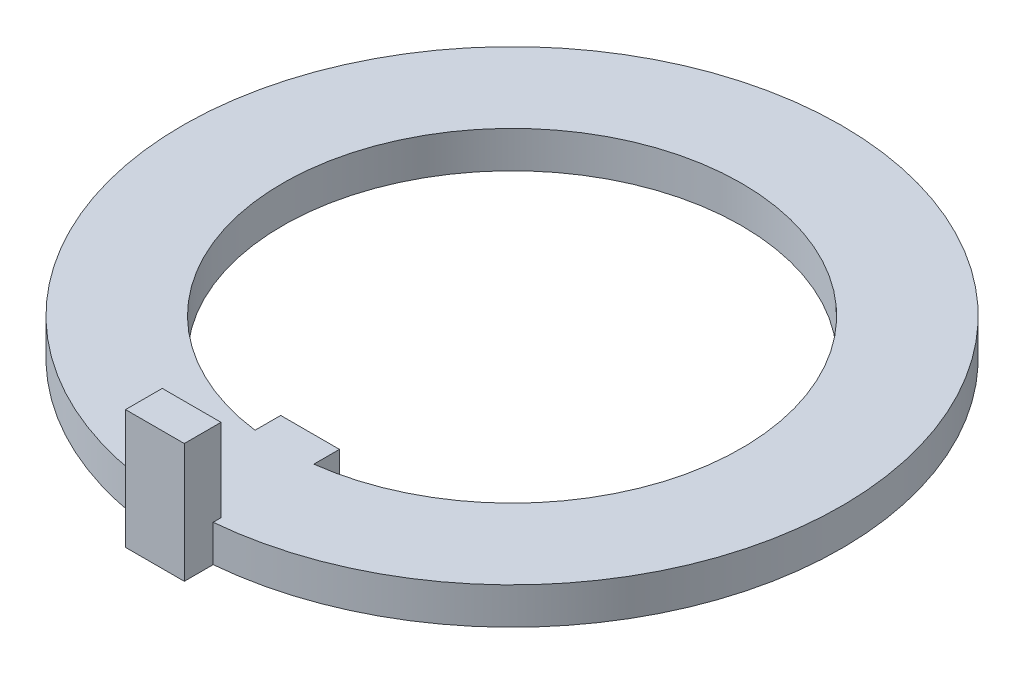
ISO-10303-21;
HEADER;
FILE_DESCRIPTION(('STEP AP214'),'2;1');
FILE_NAME('part.step','',(''),(''),'','','');
FILE_SCHEMA(('AUTOMOTIVE_DESIGN { 1 0 10303 214 1 1 1 1 }'));
ENDSEC;
DATA;
#1=APPLICATION_CONTEXT('core data for automotive mechanical design processes');
#2=APPLICATION_PROTOCOL_DEFINITION('international standard','automotive_design',2000,#1);
#3=PRODUCT_CONTEXT('',#1,'mechanical');
#4=PRODUCT('Part','Part','',(#3));
#5=PRODUCT_RELATED_PRODUCT_CATEGORY('part','',(#4));
#6=PRODUCT_DEFINITION_FORMATION('','',#4);
#7=PRODUCT_DEFINITION_CONTEXT('part definition',#1,'design');
#8=PRODUCT_DEFINITION('design','',#6,#7);
#9=PRODUCT_DEFINITION_SHAPE('','',#8);
#10=(LENGTH_UNIT() NAMED_UNIT(*) SI_UNIT(.MILLI.,.METRE.));
#11=(NAMED_UNIT(*) PLANE_ANGLE_UNIT() SI_UNIT($,.RADIAN.));
#12=(NAMED_UNIT(*) SI_UNIT($,.STERADIAN.) SOLID_ANGLE_UNIT());
#13=UNCERTAINTY_MEASURE_WITH_UNIT(LENGTH_MEASURE(1.E-05),#10,'distance_accuracy_value','');
#14=(GEOMETRIC_REPRESENTATION_CONTEXT(3) GLOBAL_UNCERTAINTY_ASSIGNED_CONTEXT((#13)) GLOBAL_UNIT_ASSIGNED_CONTEXT((#10,
#11,#12)) REPRESENTATION_CONTEXT('',''));
#15=CARTESIAN_POINT('',(0.,0.,0.));
#16=DIRECTION('',(0.,0.,1.));
#17=DIRECTION('',(1.,0.,0.));
#18=AXIS2_PLACEMENT_3D('',#15,#16,#17);
#19=CARTESIAN_POINT('',(0.,1.016,0.));
#20=DIRECTION('',(0.,1.,0.));
#21=DIRECTION('',(0.,0.,1.));
#22=AXIS2_PLACEMENT_3D('',#19,#20,#21);
#23=PLANE('',#22);
#24=DIRECTION('',(0.,0.,1.));
#25=VECTOR('',#24,1.);
#26=CARTESIAN_POINT('',(-0.8128,1.016,9.8806));
#27=LINE('',#26,#25);
#28=CARTESIAN_POINT('',(-0.8128,1.016,8.8646));
#29=VERTEX_POINT('',#28);
#30=CARTESIAN_POINT('',(-0.8128,1.016,9.08230268819532));
#31=VERTEX_POINT('',#30);
#32=EDGE_CURVE('E51',#29,#31,#27,.T.);
#33=ORIENTED_EDGE('',*,*,#32,.F.);
#34=DIRECTION('',(-1.,0.,0.));
#35=VECTOR('',#34,1.);
#36=CARTESIAN_POINT('',(-0.8128,1.016,8.8646));
#37=LINE('',#36,#35);
#38=CARTESIAN_POINT('',(0.8128,1.016,8.8646));
#39=VERTEX_POINT('',#38);
#40=EDGE_CURVE('E139',#39,#29,#37,.T.);
#41=ORIENTED_EDGE('',*,*,#40,.F.);
#42=DIRECTION('',(0.,0.,-1.));
#43=VECTOR('',#42,1.);
#44=CARTESIAN_POINT('',(0.8128,1.016,9.8806));
#45=LINE('',#44,#43);
#46=CARTESIAN_POINT('',(0.8128,1.016,9.08230268819532));
#47=VERTEX_POINT('',#46);
#48=EDGE_CURVE('E11',#47,#39,#45,.T.);
#49=ORIENTED_EDGE('',*,*,#48,.F.);
#50=CARTESIAN_POINT('',(0.,1.016,0.));
#51=DIRECTION('',(0.,1.,0.));
#52=DIRECTION('',(0.,0.,1.));
#53=AXIS2_PLACEMENT_3D('',#50,#51,#52);
#54=CIRCLE('',#53,9.1186);
#55=EDGE_CURVE('E160',#47,#31,#54,.T.);
#56=ORIENTED_EDGE('',*,*,#55,.T.);
#57=EDGE_LOOP('',(#33,#41,#49,#56));
#58=FACE_BOUND('',#57,.T.);
#59=DIRECTION('',(1.,0.,0.));
#60=VECTOR('',#59,1.);
#61=CARTESIAN_POINT('',(0.8128,1.016,5.588));
#62=LINE('',#61,#60);
#63=CARTESIAN_POINT('',(-0.8128,1.016,5.588));
#64=VERTEX_POINT('',#63);
#65=CARTESIAN_POINT('',(0.8128,1.016,5.588));
#66=VERTEX_POINT('',#65);
#67=EDGE_CURVE('E209',#64,#66,#62,.T.);
#68=ORIENTED_EDGE('',*,*,#67,.F.);
#69=DIRECTION('',(0.,0.,-1.));
#70=VECTOR('',#69,1.);
#71=CARTESIAN_POINT('',(-0.8128,1.016,6.29776596580089));
#72=LINE('',#71,#70);
#73=CARTESIAN_POINT('',(-0.812800000000002,1.016,6.29776596580089));
#74=VERTEX_POINT('',#73);
#75=EDGE_CURVE('E153',#74,#64,#72,.T.);
#76=ORIENTED_EDGE('',*,*,#75,.F.);
#77=CARTESIAN_POINT('',(0.,1.016,0.));
#78=DIRECTION('',(0.,1.,0.));
#79=DIRECTION('',(0.,0.,1.));
#80=AXIS2_PLACEMENT_3D('',#77,#78,#79);
#81=CIRCLE('',#80,6.35);
#82=CARTESIAN_POINT('',(0.8128,1.016,6.29776596580089));
#83=VERTEX_POINT('',#82);
#84=EDGE_CURVE('E195',#83,#74,#81,.T.);
#85=ORIENTED_EDGE('',*,*,#84,.F.);
#86=DIRECTION('',(0.,0.,1.));
#87=VECTOR('',#86,1.);
#88=CARTESIAN_POINT('',(0.8128,1.016,6.29776596580089));
#89=LINE('',#88,#87);
#90=EDGE_CURVE('E208',#66,#83,#89,.T.);
#91=ORIENTED_EDGE('',*,*,#90,.F.);
#92=EDGE_LOOP('',(#68,#76,#85,#91));
#93=FACE_BOUND('',#92,.T.);
#94=ADVANCED_FACE('F34',(#58,#93),#23,.T.);
#95=CARTESIAN_POINT('',(0.,0.,0.));
#96=DIRECTION('',(0.,1.,0.));
#97=DIRECTION('',(0.,0.,1.));
#98=AXIS2_PLACEMENT_3D('',#95,#96,#97);
#99=PLANE('',#98);
#100=DIRECTION('',(0.,0.,-1.));
#101=VECTOR('',#100,1.);
#102=CARTESIAN_POINT('',(0.8128,0.,9.8806));
#103=LINE('',#102,#101);
#104=CARTESIAN_POINT('',(0.8128,0.,9.8806));
#105=VERTEX_POINT('',#104);
#106=CARTESIAN_POINT('',(0.8128,0.,9.08230268819532));
#107=VERTEX_POINT('',#106);
#108=EDGE_CURVE('E178',#105,#107,#103,.T.);
#109=ORIENTED_EDGE('',*,*,#108,.F.);
#110=DIRECTION('',(1.,0.,0.));
#111=VECTOR('',#110,1.);
#112=CARTESIAN_POINT('',(0.8128,0.,9.8806));
#113=LINE('',#112,#111);
#114=CARTESIAN_POINT('',(-0.8128,0.,9.8806));
#115=VERTEX_POINT('',#114);
#116=EDGE_CURVE('E162',#115,#105,#113,.T.);
#117=ORIENTED_EDGE('',*,*,#116,.F.);
#118=DIRECTION('',(0.,0.,1.));
#119=VECTOR('',#118,1.);
#120=CARTESIAN_POINT('',(-0.8128,0.,9.8806));
#121=LINE('',#120,#119);
#122=CARTESIAN_POINT('',(-0.8128,0.,9.08230268819532));
#123=VERTEX_POINT('',#122);
#124=EDGE_CURVE('E121',#123,#115,#121,.T.);
#125=ORIENTED_EDGE('',*,*,#124,.F.);
#126=CARTESIAN_POINT('',(0.,0.,0.));
#127=DIRECTION('',(0.,1.,0.));
#128=DIRECTION('',(0.,0.,1.));
#129=AXIS2_PLACEMENT_3D('',#126,#127,#128);
#130=CIRCLE('',#129,9.1186);
#131=EDGE_CURVE('E175',#107,#123,#130,.T.);
#132=ORIENTED_EDGE('',*,*,#131,.F.);
#133=EDGE_LOOP('',(#109,#117,#125,#132));
#134=FACE_BOUND('',#133,.T.);
#135=DIRECTION('',(0.,0.,-1.));
#136=VECTOR('',#135,1.);
#137=CARTESIAN_POINT('',(-0.8128,0.,6.29776596580089));
#138=LINE('',#137,#136);
#139=CARTESIAN_POINT('',(-0.812800000000002,0.,6.29776596580089));
#140=VERTEX_POINT('',#139);
#141=CARTESIAN_POINT('',(-0.8128,0.,5.588));
#142=VERTEX_POINT('',#141);
#143=EDGE_CURVE('E150',#140,#142,#138,.T.);
#144=ORIENTED_EDGE('',*,*,#143,.T.);
#145=DIRECTION('',(1.,0.,0.));
#146=VECTOR('',#145,1.);
#147=CARTESIAN_POINT('',(0.8128,0.,5.588));
#148=LINE('',#147,#146);
#149=CARTESIAN_POINT('',(0.8128,0.,5.588));
#150=VERTEX_POINT('',#149);
#151=EDGE_CURVE('E202',#142,#150,#148,.T.);
#152=ORIENTED_EDGE('',*,*,#151,.T.);
#153=DIRECTION('',(0.,0.,1.));
#154=VECTOR('',#153,1.);
#155=CARTESIAN_POINT('',(0.8128,0.,6.29776596580089));
#156=LINE('',#155,#154);
#157=CARTESIAN_POINT('',(0.8128,0.,6.29776596580089));
#158=VERTEX_POINT('',#157);
#159=EDGE_CURVE('E199',#150,#158,#156,.T.);
#160=ORIENTED_EDGE('',*,*,#159,.T.);
#161=CARTESIAN_POINT('',(0.,0.,0.));
#162=DIRECTION('',(0.,1.,0.));
#163=DIRECTION('',(0.,0.,1.));
#164=AXIS2_PLACEMENT_3D('',#161,#162,#163);
#165=CIRCLE('',#164,6.35);
#166=EDGE_CURVE('E196',#158,#140,#165,.T.);
#167=ORIENTED_EDGE('',*,*,#166,.T.);
#168=EDGE_LOOP('',(#144,#152,#160,#167));
#169=FACE_BOUND('',#168,.T.);
#170=ADVANCED_FACE('F173',(#134,#169),#99,.F.);
#171=CARTESIAN_POINT('',(0.8128,1.016,9.8806));
#172=DIRECTION('',(-1.,0.,0.));
#173=DIRECTION('',(0.,0.,1.));
#174=AXIS2_PLACEMENT_3D('',#171,#172,#173);
#175=PLANE('',#174);
#176=ORIENTED_EDGE('',*,*,#108,.T.);
#177=DIRECTION('',(0.,-1.,0.));
#178=VECTOR('',#177,1.);
#179=CARTESIAN_POINT('',(0.8128,1.016,9.08230268819532));
#180=LINE('',#179,#178);
#181=EDGE_CURVE('E43',#47,#107,#180,.T.);
#182=ORIENTED_EDGE('',*,*,#181,.F.);
#183=ORIENTED_EDGE('',*,*,#48,.T.);
#184=DIRECTION('',(0.,-1.,0.));
#185=VECTOR('',#184,1.);
#186=CARTESIAN_POINT('',(0.8128,3.302,8.8646));
#187=LINE('',#186,#185);
#188=CARTESIAN_POINT('',(0.8128,3.302,8.8646));
#189=VERTEX_POINT('',#188);
#190=EDGE_CURVE('E147',#189,#39,#187,.T.);
#191=ORIENTED_EDGE('',*,*,#190,.F.);
#192=DIRECTION('',(0.,0.,-1.));
#193=VECTOR('',#192,1.);
#194=CARTESIAN_POINT('',(0.8128,3.302,9.8806));
#195=LINE('',#194,#193);
#196=CARTESIAN_POINT('',(0.8128,3.302,9.8806));
#197=VERTEX_POINT('',#196);
#198=EDGE_CURVE('E133',#197,#189,#195,.T.);
#199=ORIENTED_EDGE('',*,*,#198,.F.);
#200=DIRECTION('',(0.,-1.,0.));
#201=VECTOR('',#200,1.);
#202=CARTESIAN_POINT('',(0.8128,1.016,9.8806));
#203=LINE('',#202,#201);
#204=EDGE_CURVE('E125',#197,#105,#203,.T.);
#205=ORIENTED_EDGE('',*,*,#204,.T.);
#206=EDGE_LOOP('',(#176,#182,#183,#191,#199,#205));
#207=FACE_BOUND('',#206,.T.);
#208=ADVANCED_FACE('F36',(#207),#175,.F.);
#209=CARTESIAN_POINT('',(0.,1.016,0.));
#210=DIRECTION('',(0.,-1.,0.));
#211=DIRECTION('',(0.,0.,-1.));
#212=AXIS2_PLACEMENT_3D('',#209,#210,#211);
#213=CYLINDRICAL_SURFACE('',#212,9.1186);
#214=ORIENTED_EDGE('',*,*,#131,.T.);
#215=DIRECTION('',(0.,-1.,0.));
#216=VECTOR('',#215,1.);
#217=CARTESIAN_POINT('',(-0.8128,1.016,9.08230268819532));
#218=LINE('',#217,#216);
#219=EDGE_CURVE('E124',#31,#123,#218,.T.);
#220=ORIENTED_EDGE('',*,*,#219,.F.);
#221=ORIENTED_EDGE('',*,*,#55,.F.);
#222=ORIENTED_EDGE('',*,*,#181,.T.);
#223=EDGE_LOOP('',(#214,#220,#221,#222));
#224=FACE_BOUND('',#223,.T.);
#225=ADVANCED_FACE('F248',(#224),#213,.T.);
#226=CARTESIAN_POINT('',(-0.8128,1.016,9.8806));
#227=DIRECTION('',(1.,0.,0.));
#228=DIRECTION('',(0.,0.,-1.));
#229=AXIS2_PLACEMENT_3D('',#226,#227,#228);
#230=PLANE('',#229);
#231=ORIENTED_EDGE('',*,*,#124,.T.);
#232=DIRECTION('',(0.,-1.,0.));
#233=VECTOR('',#232,1.);
#234=CARTESIAN_POINT('',(-0.8128,1.016,9.8806));
#235=LINE('',#234,#233);
#236=CARTESIAN_POINT('',(-0.8128,3.302,9.8806));
#237=VERTEX_POINT('',#236);
#238=EDGE_CURVE('E113',#237,#115,#235,.T.);
#239=ORIENTED_EDGE('',*,*,#238,.F.);
#240=DIRECTION('',(0.,0.,1.));
#241=VECTOR('',#240,1.);
#242=CARTESIAN_POINT('',(-0.8128,3.302,9.8806));
#243=LINE('',#242,#241);
#244=CARTESIAN_POINT('',(-0.8128,3.302,8.8646));
#245=VERTEX_POINT('',#244);
#246=EDGE_CURVE('E118',#245,#237,#243,.T.);
#247=ORIENTED_EDGE('',*,*,#246,.F.);
#248=DIRECTION('',(0.,-1.,0.));
#249=VECTOR('',#248,1.);
#250=CARTESIAN_POINT('',(-0.8128,3.302,8.8646));
#251=LINE('',#250,#249);
#252=EDGE_CURVE('E144',#245,#29,#251,.T.);
#253=ORIENTED_EDGE('',*,*,#252,.T.);
#254=ORIENTED_EDGE('',*,*,#32,.T.);
#255=ORIENTED_EDGE('',*,*,#219,.T.);
#256=EDGE_LOOP('',(#231,#239,#247,#253,#254,#255));
#257=FACE_BOUND('',#256,.T.);
#258=ADVANCED_FACE('F115',(#257),#230,.F.);
#259=CARTESIAN_POINT('',(0.8128,1.016,9.8806));
#260=DIRECTION('',(0.,0.,-1.));
#261=DIRECTION('',(-1.,0.,0.));
#262=AXIS2_PLACEMENT_3D('',#259,#260,#261);
#263=PLANE('',#262);
#264=ORIENTED_EDGE('',*,*,#116,.T.);
#265=ORIENTED_EDGE('',*,*,#204,.F.);
#266=DIRECTION('',(1.,0.,0.));
#267=VECTOR('',#266,1.);
#268=CARTESIAN_POINT('',(-0.8128,3.302,9.8806));
#269=LINE('',#268,#267);
#270=EDGE_CURVE('E128',#237,#197,#269,.T.);
#271=ORIENTED_EDGE('',*,*,#270,.F.);
#272=ORIENTED_EDGE('',*,*,#238,.T.);
#273=EDGE_LOOP('',(#264,#265,#271,#272));
#274=FACE_BOUND('',#273,.T.);
#275=ADVANCED_FACE('F129',(#274),#263,.F.);
#276=CARTESIAN_POINT('',(-0.8128,1.016,6.29776596580089));
#277=DIRECTION('',(-1.,0.,0.));
#278=DIRECTION('',(0.,0.,1.));
#279=AXIS2_PLACEMENT_3D('',#276,#277,#278);
#280=PLANE('',#279);
#281=ORIENTED_EDGE('',*,*,#143,.F.);
#282=DIRECTION('',(0.,-1.,0.));
#283=VECTOR('',#282,1.);
#284=CARTESIAN_POINT('',(-0.812800000000002,1.016,6.29776596580089));
#285=LINE('',#284,#283);
#286=EDGE_CURVE('E192',#74,#140,#285,.T.);
#287=ORIENTED_EDGE('',*,*,#286,.F.);
#288=ORIENTED_EDGE('',*,*,#75,.T.);
#289=DIRECTION('',(0.,-1.,0.));
#290=VECTOR('',#289,1.);
#291=CARTESIAN_POINT('',(-0.8128,1.016,5.588));
#292=LINE('',#291,#290);
#293=EDGE_CURVE('E185',#64,#142,#292,.T.);
#294=ORIENTED_EDGE('',*,*,#293,.T.);
#295=EDGE_LOOP('',(#281,#287,#288,#294));
#296=FACE_BOUND('',#295,.T.);
#297=ADVANCED_FACE('F217',(#296),#280,.T.);
#298=CARTESIAN_POINT('',(0.8128,1.016,5.588));
#299=DIRECTION('',(0.,0.,-1.));
#300=DIRECTION('',(-1.,0.,0.));
#301=AXIS2_PLACEMENT_3D('',#298,#299,#300);
#302=PLANE('',#301);
#303=ORIENTED_EDGE('',*,*,#151,.F.);
#304=ORIENTED_EDGE('',*,*,#293,.F.);
#305=ORIENTED_EDGE('',*,*,#67,.T.);
#306=DIRECTION('',(0.,-1.,0.));
#307=VECTOR('',#306,1.);
#308=CARTESIAN_POINT('',(0.8128,1.016,5.588));
#309=LINE('',#308,#307);
#310=EDGE_CURVE('E187',#66,#150,#309,.T.);
#311=ORIENTED_EDGE('',*,*,#310,.T.);
#312=EDGE_LOOP('',(#303,#304,#305,#311));
#313=FACE_BOUND('',#312,.T.);
#314=ADVANCED_FACE('F220',(#313),#302,.T.);
#315=CARTESIAN_POINT('',(0.8128,1.016,6.29776596580089));
#316=DIRECTION('',(1.,0.,0.));
#317=DIRECTION('',(0.,0.,-1.));
#318=AXIS2_PLACEMENT_3D('',#315,#316,#317);
#319=PLANE('',#318);
#320=ORIENTED_EDGE('',*,*,#159,.F.);
#321=ORIENTED_EDGE('',*,*,#310,.F.);
#322=ORIENTED_EDGE('',*,*,#90,.T.);
#323=DIRECTION('',(0.,-1.,0.));
#324=VECTOR('',#323,1.);
#325=CARTESIAN_POINT('',(0.8128,1.016,6.29776596580089));
#326=LINE('',#325,#324);
#327=EDGE_CURVE('E59',#83,#158,#326,.T.);
#328=ORIENTED_EDGE('',*,*,#327,.T.);
#329=EDGE_LOOP('',(#320,#321,#322,#328));
#330=FACE_BOUND('',#329,.T.);
#331=ADVANCED_FACE('F224',(#330),#319,.T.);
#332=CARTESIAN_POINT('',(0.,1.016,0.));
#333=DIRECTION('',(0.,-1.,0.));
#334=DIRECTION('',(0.,0.,-1.));
#335=AXIS2_PLACEMENT_3D('',#332,#333,#334);
#336=CYLINDRICAL_SURFACE('',#335,6.35);
#337=ORIENTED_EDGE('',*,*,#166,.F.);
#338=ORIENTED_EDGE('',*,*,#327,.F.);
#339=ORIENTED_EDGE('',*,*,#84,.T.);
#340=ORIENTED_EDGE('',*,*,#286,.T.);
#341=EDGE_LOOP('',(#337,#338,#339,#340));
#342=FACE_BOUND('',#341,.T.);
#343=ADVANCED_FACE('F225',(#342),#336,.F.);
#344=CARTESIAN_POINT('',(-0.8128,3.302,8.8646));
#345=DIRECTION('',(0.,0.,1.));
#346=DIRECTION('',(1.,0.,0.));
#347=AXIS2_PLACEMENT_3D('',#344,#345,#346);
#348=PLANE('',#347);
#349=ORIENTED_EDGE('',*,*,#40,.T.);
#350=ORIENTED_EDGE('',*,*,#252,.F.);
#351=DIRECTION('',(-1.,0.,0.));
#352=VECTOR('',#351,1.);
#353=CARTESIAN_POINT('',(-0.8128,3.302,8.8646));
#354=LINE('',#353,#352);
#355=EDGE_CURVE('E137',#189,#245,#354,.T.);
#356=ORIENTED_EDGE('',*,*,#355,.F.);
#357=ORIENTED_EDGE('',*,*,#190,.T.);
#358=EDGE_LOOP('',(#349,#350,#356,#357));
#359=FACE_BOUND('',#358,.T.);
#360=ADVANCED_FACE('F227',(#359),#348,.F.);
#361=CARTESIAN_POINT('',(0.,3.302,0.));
#362=DIRECTION('',(0.,-1.,0.));
#363=DIRECTION('',(0.,0.,-1.));
#364=AXIS2_PLACEMENT_3D('',#361,#362,#363);
#365=PLANE('',#364);
#366=ORIENTED_EDGE('',*,*,#246,.T.);
#367=ORIENTED_EDGE('',*,*,#270,.T.);
#368=ORIENTED_EDGE('',*,*,#198,.T.);
#369=ORIENTED_EDGE('',*,*,#355,.T.);
#370=EDGE_LOOP('',(#366,#367,#368,#369));
#371=FACE_BOUND('',#370,.T.);
#372=ADVANCED_FACE('F135',(#371),#365,.F.);
#373=CLOSED_SHELL('',(#94,#170,#208,#225,#258,#275,#297,#314,#331,#343,#360,#372));
#374=MANIFOLD_SOLID_BREP('B2',#373);
#375=ADVANCED_BREP_SHAPE_REPRESENTATION('',(#18,#374),#14);
#376=SHAPE_DEFINITION_REPRESENTATION(#9,#375);
ENDSEC;
END-ISO-10303-21;
